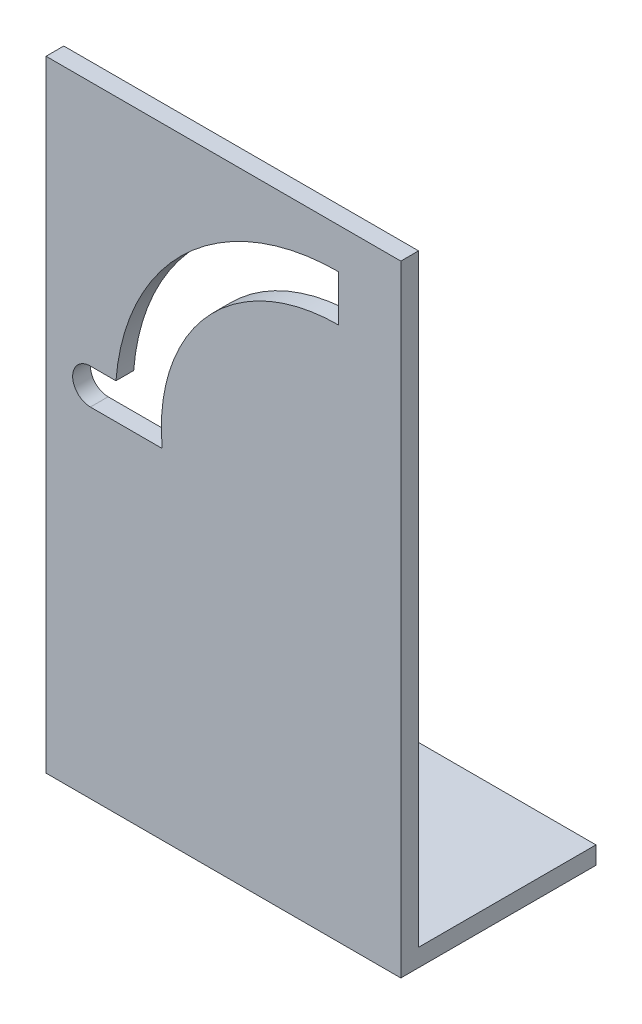
ISO-10303-21;
HEADER;
FILE_DESCRIPTION(('STEP AP214'),'2;1');
FILE_NAME('part.step','',(''),(''),'','','');
FILE_SCHEMA(('AUTOMOTIVE_DESIGN { 1 0 10303 214 1 1 1 1 }'));
ENDSEC;
DATA;
#1=APPLICATION_CONTEXT('core data for automotive mechanical design processes');
#2=APPLICATION_PROTOCOL_DEFINITION('international standard','automotive_design',2000,#1);
#3=PRODUCT_CONTEXT('',#1,'mechanical');
#4=PRODUCT('Part','Part','',(#3));
#5=PRODUCT_RELATED_PRODUCT_CATEGORY('part','',(#4));
#6=PRODUCT_DEFINITION_FORMATION('','',#4);
#7=PRODUCT_DEFINITION_CONTEXT('part definition',#1,'design');
#8=PRODUCT_DEFINITION('design','',#6,#7);
#9=PRODUCT_DEFINITION_SHAPE('','',#8);
#10=(LENGTH_UNIT() NAMED_UNIT(*) SI_UNIT(.MILLI.,.METRE.));
#11=(NAMED_UNIT(*) PLANE_ANGLE_UNIT() SI_UNIT($,.RADIAN.));
#12=(NAMED_UNIT(*) SI_UNIT($,.STERADIAN.) SOLID_ANGLE_UNIT());
#13=UNCERTAINTY_MEASURE_WITH_UNIT(LENGTH_MEASURE(1.E-05),#10,'distance_accuracy_value','');
#14=(GEOMETRIC_REPRESENTATION_CONTEXT(3) GLOBAL_UNCERTAINTY_ASSIGNED_CONTEXT((#13)) GLOBAL_UNIT_ASSIGNED_CONTEXT((#10,
#11,#12)) REPRESENTATION_CONTEXT('',''));
#15=CARTESIAN_POINT('',(0.,0.,0.));
#16=DIRECTION('',(0.,0.,1.));
#17=DIRECTION('',(1.,0.,0.));
#18=AXIS2_PLACEMENT_3D('',#15,#16,#17);
#19=CARTESIAN_POINT('',(0.,0.,2.));
#20=DIRECTION('',(0.,0.,1.));
#21=DIRECTION('',(1.,0.,0.));
#22=AXIS2_PLACEMENT_3D('',#19,#20,#21);
#23=PLANE('',#22);
#24=DIRECTION('',(0.,-1.,0.));
#25=VECTOR('',#24,1.);
#26=CARTESIAN_POINT('',(-30.2714458192476,30.2805792273283,2.));
#27=LINE('',#26,#25);
#28=CARTESIAN_POINT('',(-30.2714458192476,30.2805792273283,2.));
#29=VERTEX_POINT('',#28);
#30=CARTESIAN_POINT('',(-30.2714458192476,-39.7194207726717,2.));
#31=VERTEX_POINT('',#30);
#32=EDGE_CURVE('E204',#29,#31,#27,.T.);
#33=ORIENTED_EDGE('',*,*,#32,.T.);
#34=DIRECTION('',(1.,0.,0.));
#35=VECTOR('',#34,1.);
#36=CARTESIAN_POINT('',(-30.2714458192476,-39.7194207726717,2.));
#37=LINE('',#36,#35);
#38=CARTESIAN_POINT('',(9.72855418075238,-39.7194207726717,2.));
#39=VERTEX_POINT('',#38);
#40=EDGE_CURVE('E207',#31,#39,#37,.T.);
#41=ORIENTED_EDGE('',*,*,#40,.T.);
#42=DIRECTION('',(0.,1.,0.));
#43=VECTOR('',#42,1.);
#44=CARTESIAN_POINT('',(9.72855418075238,-39.7194207726717,2.));
#45=LINE('',#44,#43);
#46=CARTESIAN_POINT('',(9.72855418075238,30.2805792273283,2.));
#47=VERTEX_POINT('',#46);
#48=EDGE_CURVE('E128',#39,#47,#45,.T.);
#49=ORIENTED_EDGE('',*,*,#48,.T.);
#50=DIRECTION('',(-1.,0.,0.));
#51=VECTOR('',#50,1.);
#52=CARTESIAN_POINT('',(9.72855418075238,30.2805792273283,2.));
#53=LINE('',#52,#51);
#54=EDGE_CURVE('E201',#47,#29,#53,.T.);
#55=ORIENTED_EDGE('',*,*,#54,.T.);
#56=EDGE_LOOP('',(#33,#41,#49,#55));
#57=FACE_BOUND('',#56,.T.);
#58=DIRECTION('',(1.,0.,0.));
#59=VECTOR('',#58,1.);
#60=CARTESIAN_POINT('',(-25.2714458192476,-1.46942077267171,2.));
#61=LINE('',#60,#59);
#62=CARTESIAN_POINT('',(-25.2714458192476,-1.46942077267171,2.));
#63=VERTEX_POINT('',#62);
#64=CARTESIAN_POINT('',(-17.17119456138,-1.46942077267171,2.));
#65=VERTEX_POINT('',#64);
#66=EDGE_CURVE('E160',#63,#65,#61,.T.);
#67=ORIENTED_EDGE('',*,*,#66,.F.);
#68=CARTESIAN_POINT('',(-25.2714458192476,0.530579227328291,2.));
#69=DIRECTION('',(0.,0.,1.));
#70=DIRECTION('',(1.,0.,0.));
#71=AXIS2_PLACEMENT_3D('',#68,#69,#70);
#72=CIRCLE('',#71,2.);
#73=CARTESIAN_POINT('',(-25.2714458192476,2.53057922732829,2.));
#74=VERTEX_POINT('',#73);
#75=EDGE_CURVE('E158',#74,#63,#72,.T.);
#76=ORIENTED_EDGE('',*,*,#75,.F.);
#77=DIRECTION('',(-1.,0.,0.));
#78=VECTOR('',#77,1.);
#79=CARTESIAN_POINT('',(-25.2714458192476,2.53057922732829,2.));
#80=LINE('',#79,#78);
#81=CARTESIAN_POINT('',(-22.3919553682198,2.53057922732829,2.));
#82=VERTEX_POINT('',#81);
#83=EDGE_CURVE('E169',#82,#74,#80,.T.);
#84=ORIENTED_EDGE('',*,*,#83,.F.);
#85=CARTESIAN_POINT('',(2.72855418075238,0.530579227328292,2.));
#86=DIRECTION('',(0.,0.,1.));
#87=DIRECTION('',(1.,0.,0.));
#88=AXIS2_PLACEMENT_3D('',#85,#86,#87);
#89=CIRCLE('',#88,25.2);
#90=CARTESIAN_POINT('',(2.72855418075238,25.7305792273283,2.));
#91=VERTEX_POINT('',#90);
#92=EDGE_CURVE('E167',#91,#82,#89,.T.);
#93=ORIENTED_EDGE('',*,*,#92,.F.);
#94=DIRECTION('',(0.,1.,0.));
#95=VECTOR('',#94,1.);
#96=CARTESIAN_POINT('',(2.72855418075238,20.5305792273283,2.));
#97=LINE('',#96,#95);
#98=CARTESIAN_POINT('',(2.72855418075238,20.5305792273283,2.));
#99=VERTEX_POINT('',#98);
#100=EDGE_CURVE('E165',#99,#91,#97,.T.);
#101=ORIENTED_EDGE('',*,*,#100,.F.);
#102=CARTESIAN_POINT('',(2.72855418075238,0.530579227328292,2.));
#103=DIRECTION('',(0.,0.,-1.));
#104=DIRECTION('',(1.,0.,0.));
#105=AXIS2_PLACEMENT_3D('',#102,#103,#104);
#106=CIRCLE('',#105,20.);
#107=EDGE_CURVE('E163',#65,#99,#106,.T.);
#108=ORIENTED_EDGE('',*,*,#107,.F.);
#109=EDGE_LOOP('',(#67,#76,#84,#93,#101,#108));
#110=FACE_BOUND('',#109,.T.);
#111=ADVANCED_FACE('F35',(#57,#110),#23,.T.);
#112=CARTESIAN_POINT('',(0.,0.,0.));
#113=DIRECTION('',(0.,0.,1.));
#114=DIRECTION('',(1.,0.,0.));
#115=AXIS2_PLACEMENT_3D('',#112,#113,#114);
#116=PLANE('',#115);
#117=DIRECTION('',(0.,1.,0.));
#118=VECTOR('',#117,1.);
#119=CARTESIAN_POINT('',(9.72855418075238,-39.7194207726717,0.));
#120=LINE('',#119,#118);
#121=CARTESIAN_POINT('',(9.72855418075238,-37.7194207726717,0.));
#122=VERTEX_POINT('',#121);
#123=CARTESIAN_POINT('',(9.72855418075238,30.2805792273283,0.));
#124=VERTEX_POINT('',#123);
#125=EDGE_CURVE('E205',#122,#124,#120,.T.);
#126=ORIENTED_EDGE('',*,*,#125,.F.);
#127=DIRECTION('',(-1.,0.,0.));
#128=VECTOR('',#127,1.);
#129=CARTESIAN_POINT('',(0.,-37.7194207726717,0.));
#130=LINE('',#129,#128);
#131=CARTESIAN_POINT('',(-30.2714458192476,-37.7194207726717,0.));
#132=VERTEX_POINT('',#131);
#133=EDGE_CURVE('E153',#122,#132,#130,.T.);
#134=ORIENTED_EDGE('',*,*,#133,.T.);
#135=DIRECTION('',(0.,-1.,0.));
#136=VECTOR('',#135,1.);
#137=CARTESIAN_POINT('',(-30.2714458192476,30.2805792273283,0.));
#138=LINE('',#137,#136);
#139=CARTESIAN_POINT('',(-30.2714458192476,30.2805792273283,0.));
#140=VERTEX_POINT('',#139);
#141=EDGE_CURVE('E212',#140,#132,#138,.T.);
#142=ORIENTED_EDGE('',*,*,#141,.F.);
#143=DIRECTION('',(-1.,0.,0.));
#144=VECTOR('',#143,1.);
#145=CARTESIAN_POINT('',(9.72855418075238,30.2805792273283,0.));
#146=LINE('',#145,#144);
#147=EDGE_CURVE('E200',#124,#140,#146,.T.);
#148=ORIENTED_EDGE('',*,*,#147,.F.);
#149=EDGE_LOOP('',(#126,#134,#142,#148));
#150=FACE_BOUND('',#149,.T.);
#151=CARTESIAN_POINT('',(-25.2714458192476,0.530579227328291,0.));
#152=DIRECTION('',(0.,0.,1.));
#153=DIRECTION('',(1.,0.,0.));
#154=AXIS2_PLACEMENT_3D('',#151,#152,#153);
#155=CIRCLE('',#154,2.);
#156=CARTESIAN_POINT('',(-25.2714458192476,2.53057922732829,0.));
#157=VERTEX_POINT('',#156);
#158=CARTESIAN_POINT('',(-25.2714458192476,-1.46942077267171,0.));
#159=VERTEX_POINT('',#158);
#160=EDGE_CURVE('E157',#157,#159,#155,.T.);
#161=ORIENTED_EDGE('',*,*,#160,.T.);
#162=DIRECTION('',(1.,0.,0.));
#163=VECTOR('',#162,1.);
#164=CARTESIAN_POINT('',(-21.2714458192476,-1.46942077267171,0.));
#165=LINE('',#164,#163);
#166=CARTESIAN_POINT('',(-17.17119456138,-1.46942077267171,0.));
#167=VERTEX_POINT('',#166);
#168=EDGE_CURVE('E174',#159,#167,#165,.T.);
#169=ORIENTED_EDGE('',*,*,#168,.T.);
#170=CARTESIAN_POINT('',(2.72855418075238,0.530579227328292,0.));
#171=DIRECTION('',(0.,0.,-1.));
#172=DIRECTION('',(1.,0.,0.));
#173=AXIS2_PLACEMENT_3D('',#170,#171,#172);
#174=CIRCLE('',#173,20.);
#175=CARTESIAN_POINT('',(2.72855418075238,20.5305792273283,0.));
#176=VERTEX_POINT('',#175);
#177=EDGE_CURVE('E177',#167,#176,#174,.T.);
#178=ORIENTED_EDGE('',*,*,#177,.T.);
#179=DIRECTION('',(0.,1.,0.));
#180=VECTOR('',#179,1.);
#181=CARTESIAN_POINT('',(2.72855418075238,20.5305792273283,0.));
#182=LINE('',#181,#180);
#183=CARTESIAN_POINT('',(2.72855418075238,25.7305792273283,0.));
#184=VERTEX_POINT('',#183);
#185=EDGE_CURVE('E180',#176,#184,#182,.T.);
#186=ORIENTED_EDGE('',*,*,#185,.T.);
#187=CARTESIAN_POINT('',(2.72855418075238,0.530579227328292,0.));
#188=DIRECTION('',(0.,0.,1.));
#189=DIRECTION('',(1.,0.,0.));
#190=AXIS2_PLACEMENT_3D('',#187,#188,#189);
#191=CIRCLE('',#190,25.2);
#192=CARTESIAN_POINT('',(-22.3919553682198,2.53057922732829,0.));
#193=VERTEX_POINT('',#192);
#194=EDGE_CURVE('E183',#184,#193,#191,.T.);
#195=ORIENTED_EDGE('',*,*,#194,.T.);
#196=DIRECTION('',(-1.,0.,0.));
#197=VECTOR('',#196,1.);
#198=CARTESIAN_POINT('',(-25.2714458192476,2.53057922732829,0.));
#199=LINE('',#198,#197);
#200=EDGE_CURVE('E161',#193,#157,#199,.T.);
#201=ORIENTED_EDGE('',*,*,#200,.T.);
#202=EDGE_LOOP('',(#161,#169,#178,#186,#195,#201));
#203=FACE_BOUND('',#202,.T.);
#204=ADVANCED_FACE('F223',(#150,#203),#116,.F.);
#205=CARTESIAN_POINT('',(9.72855418075238,30.2805792273283,2.));
#206=DIRECTION('',(0.,-1.,0.));
#207=DIRECTION('',(1.,0.,0.));
#208=AXIS2_PLACEMENT_3D('',#205,#206,#207);
#209=PLANE('',#208);
#210=ORIENTED_EDGE('',*,*,#147,.T.);
#211=DIRECTION('',(0.,0.,-1.));
#212=VECTOR('',#211,1.);
#213=CARTESIAN_POINT('',(-30.2714458192476,30.2805792273283,2.));
#214=LINE('',#213,#212);
#215=EDGE_CURVE('E11',#29,#140,#214,.T.);
#216=ORIENTED_EDGE('',*,*,#215,.F.);
#217=ORIENTED_EDGE('',*,*,#54,.F.);
#218=DIRECTION('',(0.,0.,-1.));
#219=VECTOR('',#218,1.);
#220=CARTESIAN_POINT('',(9.72855418075238,30.2805792273283,2.));
#221=LINE('',#220,#219);
#222=EDGE_CURVE('E132',#47,#124,#221,.T.);
#223=ORIENTED_EDGE('',*,*,#222,.T.);
#224=EDGE_LOOP('',(#210,#216,#217,#223));
#225=FACE_BOUND('',#224,.T.);
#226=ADVANCED_FACE('F37',(#225),#209,.F.);
#227=CARTESIAN_POINT('',(-30.2714458192476,30.2805792273283,2.));
#228=DIRECTION('',(1.,0.,0.));
#229=DIRECTION('',(0.,1.,0.));
#230=AXIS2_PLACEMENT_3D('',#227,#228,#229);
#231=PLANE('',#230);
#232=ORIENTED_EDGE('',*,*,#141,.T.);
#233=DIRECTION('',(0.,0.,1.));
#234=VECTOR('',#233,1.);
#235=CARTESIAN_POINT('',(-30.2714458192476,-37.7194207726717,-20.));
#236=LINE('',#235,#234);
#237=CARTESIAN_POINT('',(-30.2714458192476,-37.7194207726717,-20.));
#238=VERTEX_POINT('',#237);
#239=EDGE_CURVE('E151',#238,#132,#236,.T.);
#240=ORIENTED_EDGE('',*,*,#239,.F.);
#241=DIRECTION('',(0.,-1.,0.));
#242=VECTOR('',#241,1.);
#243=CARTESIAN_POINT('',(-30.2714458192476,-39.7194207726717,-20.));
#244=LINE('',#243,#242);
#245=CARTESIAN_POINT('',(-30.2714458192476,-39.7194207726717,-20.));
#246=VERTEX_POINT('',#245);
#247=EDGE_CURVE('E149',#238,#246,#244,.T.);
#248=ORIENTED_EDGE('',*,*,#247,.T.);
#249=DIRECTION('',(0.,0.,-1.));
#250=VECTOR('',#249,1.);
#251=CARTESIAN_POINT('',(-30.2714458192476,-39.7194207726717,2.));
#252=LINE('',#251,#250);
#253=EDGE_CURVE('E43',#31,#246,#252,.T.);
#254=ORIENTED_EDGE('',*,*,#253,.F.);
#255=ORIENTED_EDGE('',*,*,#32,.F.);
#256=ORIENTED_EDGE('',*,*,#215,.T.);
#257=EDGE_LOOP('',(#232,#240,#248,#254,#255,#256));
#258=FACE_BOUND('',#257,.T.);
#259=ADVANCED_FACE('F226',(#258),#231,.F.);
#260=CARTESIAN_POINT('',(-30.2714458192476,-39.7194207726717,2.));
#261=DIRECTION('',(0.,1.,0.));
#262=DIRECTION('',(0.,0.,1.));
#263=AXIS2_PLACEMENT_3D('',#260,#261,#262);
#264=PLANE('',#263);
#265=ORIENTED_EDGE('',*,*,#253,.T.);
#266=DIRECTION('',(1.,0.,0.));
#267=VECTOR('',#266,1.);
#268=CARTESIAN_POINT('',(9.72855418075238,-39.7194207726717,-20.));
#269=LINE('',#268,#267);
#270=CARTESIAN_POINT('',(9.72855418075238,-39.7194207726717,-20.));
#271=VERTEX_POINT('',#270);
#272=EDGE_CURVE('E139',#246,#271,#269,.T.);
#273=ORIENTED_EDGE('',*,*,#272,.T.);
#274=DIRECTION('',(0.,0.,-1.));
#275=VECTOR('',#274,1.);
#276=CARTESIAN_POINT('',(9.72855418075238,-39.7194207726717,2.));
#277=LINE('',#276,#275);
#278=EDGE_CURVE('E123',#39,#271,#277,.T.);
#279=ORIENTED_EDGE('',*,*,#278,.F.);
#280=ORIENTED_EDGE('',*,*,#40,.F.);
#281=EDGE_LOOP('',(#265,#273,#279,#280));
#282=FACE_BOUND('',#281,.T.);
#283=ADVANCED_FACE('F144',(#282),#264,.F.);
#284=CARTESIAN_POINT('',(9.72855418075238,-39.7194207726717,2.));
#285=DIRECTION('',(-1.,0.,0.));
#286=DIRECTION('',(0.,0.,1.));
#287=AXIS2_PLACEMENT_3D('',#284,#285,#286);
#288=PLANE('',#287);
#289=ORIENTED_EDGE('',*,*,#222,.F.);
#290=ORIENTED_EDGE('',*,*,#48,.F.);
#291=ORIENTED_EDGE('',*,*,#278,.T.);
#292=DIRECTION('',(0.,1.,0.));
#293=VECTOR('',#292,1.);
#294=CARTESIAN_POINT('',(9.72855418075238,-37.7194207726717,-20.));
#295=LINE('',#294,#293);
#296=CARTESIAN_POINT('',(9.72855418075238,-37.7194207726717,-20.));
#297=VERTEX_POINT('',#296);
#298=EDGE_CURVE('E127',#271,#297,#295,.T.);
#299=ORIENTED_EDGE('',*,*,#298,.T.);
#300=DIRECTION('',(0.,0.,1.));
#301=VECTOR('',#300,1.);
#302=CARTESIAN_POINT('',(9.72855418075238,-37.7194207726717,-20.));
#303=LINE('',#302,#301);
#304=EDGE_CURVE('E50',#297,#122,#303,.T.);
#305=ORIENTED_EDGE('',*,*,#304,.T.);
#306=ORIENTED_EDGE('',*,*,#125,.T.);
#307=EDGE_LOOP('',(#289,#290,#291,#299,#305,#306));
#308=FACE_BOUND('',#307,.T.);
#309=ADVANCED_FACE('F126',(#308),#288,.F.);
#310=CARTESIAN_POINT('',(-25.2714458192476,0.530579227328291,2.));
#311=DIRECTION('',(0.,0.,-1.));
#312=DIRECTION('',(-1.,0.,0.));
#313=AXIS2_PLACEMENT_3D('',#310,#311,#312);
#314=CYLINDRICAL_SURFACE('',#313,2.);
#315=ORIENTED_EDGE('',*,*,#160,.F.);
#316=DIRECTION('',(0.,0.,-1.));
#317=VECTOR('',#316,1.);
#318=CARTESIAN_POINT('',(-25.2714458192476,2.53057922732829,2.));
#319=LINE('',#318,#317);
#320=EDGE_CURVE('E171',#74,#157,#319,.T.);
#321=ORIENTED_EDGE('',*,*,#320,.F.);
#322=ORIENTED_EDGE('',*,*,#75,.T.);
#323=DIRECTION('',(0.,0.,-1.));
#324=VECTOR('',#323,1.);
#325=CARTESIAN_POINT('',(-25.2714458192476,-1.46942077267171,2.));
#326=LINE('',#325,#324);
#327=EDGE_CURVE('E197',#63,#159,#326,.T.);
#328=ORIENTED_EDGE('',*,*,#327,.T.);
#329=EDGE_LOOP('',(#315,#321,#322,#328));
#330=FACE_BOUND('',#329,.T.);
#331=ADVANCED_FACE('F246',(#330),#314,.F.);
#332=CARTESIAN_POINT('',(-21.2714458192476,-1.46942077267171,2.));
#333=DIRECTION('',(0.,1.,0.));
#334=DIRECTION('',(0.,0.,1.));
#335=AXIS2_PLACEMENT_3D('',#332,#333,#334);
#336=PLANE('',#335);
#337=ORIENTED_EDGE('',*,*,#168,.F.);
#338=ORIENTED_EDGE('',*,*,#327,.F.);
#339=ORIENTED_EDGE('',*,*,#66,.T.);
#340=DIRECTION('',(0.,0.,-1.));
#341=VECTOR('',#340,1.);
#342=CARTESIAN_POINT('',(-17.17119456138,-1.46942077267171,2.));
#343=LINE('',#342,#341);
#344=EDGE_CURVE('E195',#65,#167,#343,.T.);
#345=ORIENTED_EDGE('',*,*,#344,.T.);
#346=EDGE_LOOP('',(#337,#338,#339,#345));
#347=FACE_BOUND('',#346,.T.);
#348=ADVANCED_FACE('F239',(#347),#336,.T.);
#349=CARTESIAN_POINT('',(2.72855418075238,0.530579227328292,2.));
#350=DIRECTION('',(0.,0.,-1.));
#351=DIRECTION('',(-1.,0.,0.));
#352=AXIS2_PLACEMENT_3D('',#349,#350,#351);
#353=CYLINDRICAL_SURFACE('',#352,20.);
#354=ORIENTED_EDGE('',*,*,#177,.F.);
#355=ORIENTED_EDGE('',*,*,#344,.F.);
#356=ORIENTED_EDGE('',*,*,#107,.T.);
#357=DIRECTION('',(0.,0.,-1.));
#358=VECTOR('',#357,1.);
#359=CARTESIAN_POINT('',(2.72855418075238,20.5305792273283,2.));
#360=LINE('',#359,#358);
#361=EDGE_CURVE('E193',#99,#176,#360,.T.);
#362=ORIENTED_EDGE('',*,*,#361,.T.);
#363=EDGE_LOOP('',(#354,#355,#356,#362));
#364=FACE_BOUND('',#363,.T.);
#365=ADVANCED_FACE('F242',(#364),#353,.T.);
#366=CARTESIAN_POINT('',(2.72855418075238,20.5305792273283,2.));
#367=DIRECTION('',(-1.,0.,0.));
#368=DIRECTION('',(0.,0.,1.));
#369=AXIS2_PLACEMENT_3D('',#366,#367,#368);
#370=PLANE('',#369);
#371=ORIENTED_EDGE('',*,*,#185,.F.);
#372=ORIENTED_EDGE('',*,*,#361,.F.);
#373=ORIENTED_EDGE('',*,*,#100,.T.);
#374=DIRECTION('',(0.,0.,-1.));
#375=VECTOR('',#374,1.);
#376=CARTESIAN_POINT('',(2.72855418075238,25.7305792273283,2.));
#377=LINE('',#376,#375);
#378=EDGE_CURVE('E191',#91,#184,#377,.T.);
#379=ORIENTED_EDGE('',*,*,#378,.T.);
#380=EDGE_LOOP('',(#371,#372,#373,#379));
#381=FACE_BOUND('',#380,.T.);
#382=ADVANCED_FACE('F255',(#381),#370,.T.);
#383=CARTESIAN_POINT('',(2.72855418075238,0.530579227328292,2.));
#384=DIRECTION('',(0.,0.,-1.));
#385=DIRECTION('',(-1.,0.,0.));
#386=AXIS2_PLACEMENT_3D('',#383,#384,#385);
#387=CYLINDRICAL_SURFACE('',#386,25.2);
#388=ORIENTED_EDGE('',*,*,#194,.F.);
#389=ORIENTED_EDGE('',*,*,#378,.F.);
#390=ORIENTED_EDGE('',*,*,#92,.T.);
#391=DIRECTION('',(0.,0.,-1.));
#392=VECTOR('',#391,1.);
#393=CARTESIAN_POINT('',(-22.3919553682198,2.53057922732829,2.));
#394=LINE('',#393,#392);
#395=EDGE_CURVE('E58',#82,#193,#394,.T.);
#396=ORIENTED_EDGE('',*,*,#395,.T.);
#397=EDGE_LOOP('',(#388,#389,#390,#396));
#398=FACE_BOUND('',#397,.T.);
#399=ADVANCED_FACE('F252',(#398),#387,.F.);
#400=CARTESIAN_POINT('',(-25.2714458192476,2.53057922732829,2.));
#401=DIRECTION('',(0.,-1.,0.));
#402=DIRECTION('',(1.,0.,0.));
#403=AXIS2_PLACEMENT_3D('',#400,#401,#402);
#404=PLANE('',#403);
#405=ORIENTED_EDGE('',*,*,#200,.F.);
#406=ORIENTED_EDGE('',*,*,#395,.F.);
#407=ORIENTED_EDGE('',*,*,#83,.T.);
#408=ORIENTED_EDGE('',*,*,#320,.T.);
#409=EDGE_LOOP('',(#405,#406,#407,#408));
#410=FACE_BOUND('',#409,.T.);
#411=ADVANCED_FACE('F248',(#410),#404,.T.);
#412=CARTESIAN_POINT('',(-30.2714458192476,-37.7194207726717,-20.));
#413=DIRECTION('',(0.,1.,0.));
#414=DIRECTION('',(0.,0.,1.));
#415=AXIS2_PLACEMENT_3D('',#412,#413,#414);
#416=PLANE('',#415);
#417=ORIENTED_EDGE('',*,*,#133,.F.);
#418=ORIENTED_EDGE('',*,*,#304,.F.);
#419=DIRECTION('',(-1.,0.,0.));
#420=VECTOR('',#419,1.);
#421=CARTESIAN_POINT('',(-30.2714458192476,-37.7194207726717,-20.));
#422=LINE('',#421,#420);
#423=EDGE_CURVE('E142',#297,#238,#422,.T.);
#424=ORIENTED_EDGE('',*,*,#423,.T.);
#425=ORIENTED_EDGE('',*,*,#239,.T.);
#426=EDGE_LOOP('',(#417,#418,#424,#425));
#427=FACE_BOUND('',#426,.T.);
#428=ADVANCED_FACE('F299',(#427),#416,.T.);
#429=CARTESIAN_POINT('',(0.,0.,-20.));
#430=DIRECTION('',(0.,0.,-1.));
#431=DIRECTION('',(-1.,0.,0.));
#432=AXIS2_PLACEMENT_3D('',#429,#430,#431);
#433=PLANE('',#432);
#434=ORIENTED_EDGE('',*,*,#272,.F.);
#435=ORIENTED_EDGE('',*,*,#247,.F.);
#436=ORIENTED_EDGE('',*,*,#423,.F.);
#437=ORIENTED_EDGE('',*,*,#298,.F.);
#438=EDGE_LOOP('',(#434,#435,#436,#437));
#439=FACE_BOUND('',#438,.T.);
#440=ADVANCED_FACE('F137',(#439),#433,.T.);
#441=CLOSED_SHELL('',(#111,#204,#226,#259,#283,#309,#331,#348,#365,#382,#399,#411,#428,#440));
#442=MANIFOLD_SOLID_BREP('B2',#441);
#443=ADVANCED_BREP_SHAPE_REPRESENTATION('',(#18,#442),#14);
#444=SHAPE_DEFINITION_REPRESENTATION(#9,#443);
ENDSEC;
END-ISO-10303-21;
